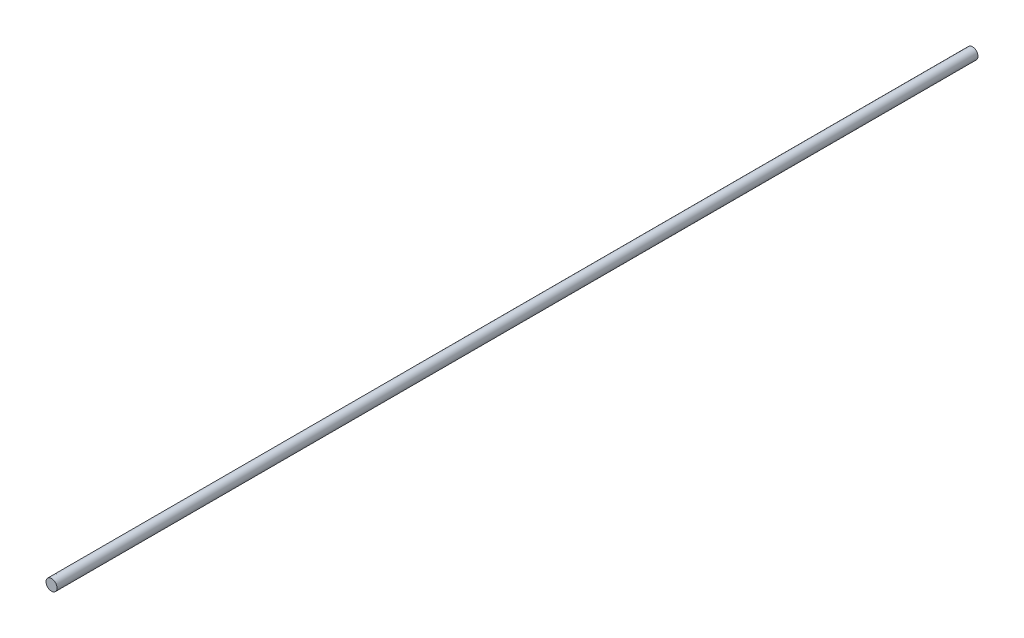
ISO-10303-21;
HEADER;
FILE_DESCRIPTION(('STEP AP214'),'2;1');
FILE_NAME('part.step','',(''),(''),'','','');
FILE_SCHEMA(('AUTOMOTIVE_DESIGN { 1 0 10303 214 1 1 1 1 }'));
ENDSEC;
DATA;
#1=APPLICATION_CONTEXT('core data for automotive mechanical design processes');
#2=APPLICATION_PROTOCOL_DEFINITION('international standard','automotive_design',2000,#1);
#3=PRODUCT_CONTEXT('',#1,'mechanical');
#4=PRODUCT('Part','Part','',(#3));
#5=PRODUCT_RELATED_PRODUCT_CATEGORY('part','',(#4));
#6=PRODUCT_DEFINITION_FORMATION('','',#4);
#7=PRODUCT_DEFINITION_CONTEXT('part definition',#1,'design');
#8=PRODUCT_DEFINITION('design','',#6,#7);
#9=PRODUCT_DEFINITION_SHAPE('','',#8);
#10=(LENGTH_UNIT() NAMED_UNIT(*) SI_UNIT(.MILLI.,.METRE.));
#11=(NAMED_UNIT(*) PLANE_ANGLE_UNIT() SI_UNIT($,.RADIAN.));
#12=(NAMED_UNIT(*) SI_UNIT($,.STERADIAN.) SOLID_ANGLE_UNIT());
#13=UNCERTAINTY_MEASURE_WITH_UNIT(LENGTH_MEASURE(1.E-05),#10,'distance_accuracy_value','');
#14=(GEOMETRIC_REPRESENTATION_CONTEXT(3) GLOBAL_UNCERTAINTY_ASSIGNED_CONTEXT((#13)) GLOBAL_UNIT_ASSIGNED_CONTEXT((#10,
#11,#12)) REPRESENTATION_CONTEXT('',''));
#15=CARTESIAN_POINT('',(0.,0.,0.));
#16=DIRECTION('',(0.,0.,1.));
#17=DIRECTION('',(1.,0.,0.));
#18=AXIS2_PLACEMENT_3D('',#15,#16,#17);
#19=CARTESIAN_POINT('',(0.,0.,250.));
#20=DIRECTION('',(0.,0.,-1.));
#21=DIRECTION('',(-1.,0.,0.));
#22=AXIS2_PLACEMENT_3D('',#19,#20,#21);
#23=CYLINDRICAL_SURFACE('',#22,3.);
#24=CARTESIAN_POINT('',(0.,0.,250.));
#25=DIRECTION('',(0.,0.,1.));
#26=DIRECTION('',(1.,0.,0.));
#27=AXIS2_PLACEMENT_3D('',#24,#25,#26);
#28=CIRCLE('',#27,3.);
#29=CARTESIAN_POINT('',(3.,0.,250.));
#30=VERTEX_POINT('',#29);
#31=EDGE_CURVE('E10',#30,#30,#28,.T.);
#32=ORIENTED_EDGE('',*,*,#31,.F.);
#33=EDGE_LOOP('',(#32));
#34=FACE_BOUND('',#33,.T.);
#35=CARTESIAN_POINT('',(0.,0.,-250.));
#36=DIRECTION('',(0.,0.,1.));
#37=DIRECTION('',(1.,0.,0.));
#38=AXIS2_PLACEMENT_3D('',#35,#36,#37);
#39=CIRCLE('',#38,3.);
#40=CARTESIAN_POINT('',(3.,0.,-250.));
#41=VERTEX_POINT('',#40);
#42=EDGE_CURVE('E38',#41,#41,#39,.T.);
#43=ORIENTED_EDGE('',*,*,#42,.T.);
#44=EDGE_LOOP('',(#43));
#45=FACE_BOUND('',#44,.T.);
#46=ADVANCED_FACE('F35',(#34,#45),#23,.T.);
#47=CARTESIAN_POINT('',(0.,0.,250.));
#48=DIRECTION('',(0.,0.,1.));
#49=DIRECTION('',(1.,0.,0.));
#50=AXIS2_PLACEMENT_3D('',#47,#48,#49);
#51=PLANE('',#50);
#52=ORIENTED_EDGE('',*,*,#31,.T.);
#53=EDGE_LOOP('',(#52));
#54=FACE_BOUND('',#53,.T.);
#55=ADVANCED_FACE('F50',(#54),#51,.T.);
#56=CARTESIAN_POINT('',(0.,0.,-250.));
#57=DIRECTION('',(0.,0.,1.));
#58=DIRECTION('',(1.,0.,0.));
#59=AXIS2_PLACEMENT_3D('',#56,#57,#58);
#60=PLANE('',#59);
#61=ORIENTED_EDGE('',*,*,#42,.F.);
#62=EDGE_LOOP('',(#61));
#63=FACE_BOUND('',#62,.T.);
#64=ADVANCED_FACE('F48',(#63),#60,.F.);
#65=CLOSED_SHELL('',(#46,#55,#64));
#66=MANIFOLD_SOLID_BREP('B2',#65);
#67=ADVANCED_BREP_SHAPE_REPRESENTATION('',(#18,#66),#14);
#68=SHAPE_DEFINITION_REPRESENTATION(#9,#67);
ENDSEC;
END-ISO-10303-21;
